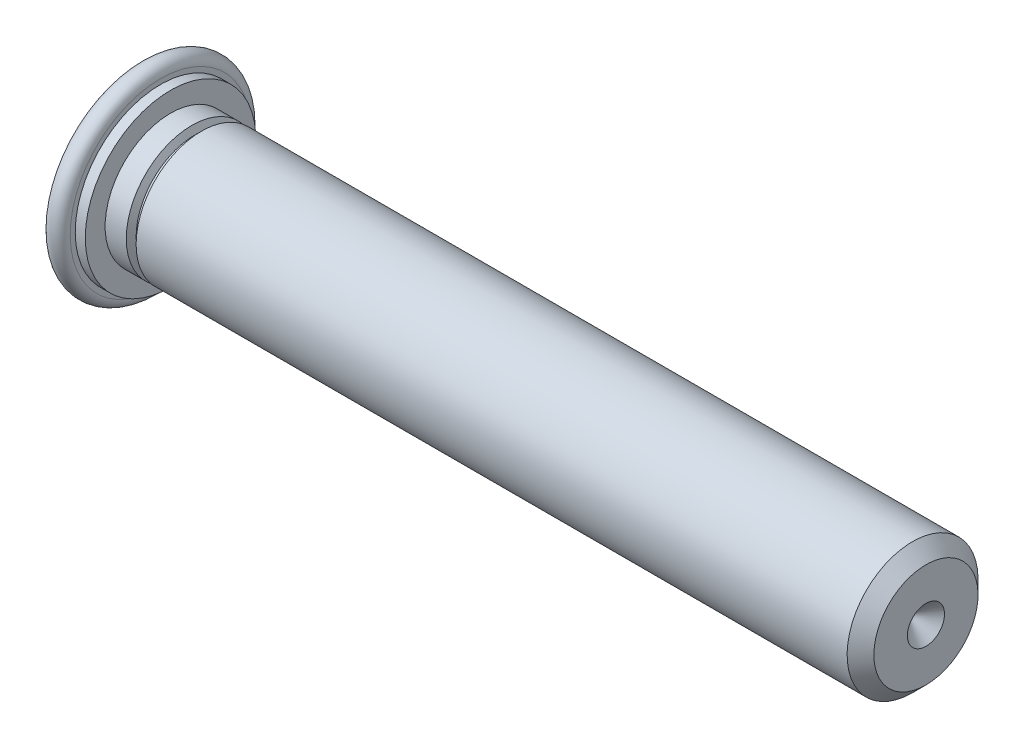
ISO-10303-21;
HEADER;
FILE_DESCRIPTION(('STEP AP214'),'2;1');
FILE_NAME('part.step','',(''),(''),'','','');
FILE_SCHEMA(('AUTOMOTIVE_DESIGN { 1 0 10303 214 1 1 1 1 }'));
ENDSEC;
DATA;
#1=APPLICATION_CONTEXT('core data for automotive mechanical design processes');
#2=APPLICATION_PROTOCOL_DEFINITION('international standard','automotive_design',2000,#1);
#3=PRODUCT_CONTEXT('',#1,'mechanical');
#4=PRODUCT('Part','Part','',(#3));
#5=PRODUCT_RELATED_PRODUCT_CATEGORY('part','',(#4));
#6=PRODUCT_DEFINITION_FORMATION('','',#4);
#7=PRODUCT_DEFINITION_CONTEXT('part definition',#1,'design');
#8=PRODUCT_DEFINITION('design','',#6,#7);
#9=PRODUCT_DEFINITION_SHAPE('','',#8);
#10=(LENGTH_UNIT() NAMED_UNIT(*) SI_UNIT(.MILLI.,.METRE.));
#11=(NAMED_UNIT(*) PLANE_ANGLE_UNIT() SI_UNIT($,.RADIAN.));
#12=(NAMED_UNIT(*) SI_UNIT($,.STERADIAN.) SOLID_ANGLE_UNIT());
#13=UNCERTAINTY_MEASURE_WITH_UNIT(LENGTH_MEASURE(1.E-05),#10,'distance_accuracy_value','');
#14=(GEOMETRIC_REPRESENTATION_CONTEXT(3) GLOBAL_UNCERTAINTY_ASSIGNED_CONTEXT((#13)) GLOBAL_UNIT_ASSIGNED_CONTEXT((#10,
#11,#12)) REPRESENTATION_CONTEXT('',''));
#15=CARTESIAN_POINT('',(0.,0.,0.));
#16=DIRECTION('',(0.,0.,1.));
#17=DIRECTION('',(1.,0.,0.));
#18=AXIS2_PLACEMENT_3D('',#15,#16,#17);
#19=CARTESIAN_POINT('',(18.00000972,0.,0.));
#20=DIRECTION('',(1.,0.,0.));
#21=DIRECTION('',(0.,0.,-1.));
#22=AXIS2_PLACEMENT_3D('',#19,#20,#21);
#23=CONICAL_SURFACE('',#22,0.42550022977,0.785398163397447);
#24=CARTESIAN_POINT('',(17.57450949023,0.,0.));
#25=VERTEX_POINT('',#24);
#26=VERTEX_LOOP('',#25);
#27=FACE_BOUND('',#26,.T.);
#28=CARTESIAN_POINT('',(18.00000972,0.,0.));
#29=DIRECTION('',(1.,0.,0.));
#30=DIRECTION('',(0.,0.,-1.));
#31=AXIS2_PLACEMENT_3D('',#28,#29,#30);
#32=CIRCLE('',#31,0.42550022977);
#33=CARTESIAN_POINT('',(18.00000972,0.,-0.42550022977));
#34=VERTEX_POINT('',#33);
#35=EDGE_CURVE('E21',#34,#34,#32,.F.);
#36=ORIENTED_EDGE('',*,*,#35,.F.);
#37=EDGE_LOOP('',(#36));
#38=FACE_BOUND('',#37,.T.);
#39=ADVANCED_FACE('F17',(#27,#38),#23,.F.);
#40=CARTESIAN_POINT('',(18.00000972,-1.2173706573798,1.19350064449));
#41=DIRECTION('',(1.,0.,0.));
#42=DIRECTION('',(0.,0.,-1.));
#43=AXIS2_PLACEMENT_3D('',#40,#41,#42);
#44=PLANE('',#43);
#45=CARTESIAN_POINT('',(18.00000972,0.,0.));
#46=DIRECTION('',(-1.,0.,0.));
#47=DIRECTION('',(0.,-1.,0.));
#48=AXIS2_PLACEMENT_3D('',#45,#46,#47);
#49=CIRCLE('',#48,1.19350064449);
#50=CARTESIAN_POINT('',(18.00000972,-1.19350064449,0.));
#51=VERTEX_POINT('',#50);
#52=EDGE_CURVE('E36',#51,#51,#49,.T.);
#53=ORIENTED_EDGE('',*,*,#52,.F.);
#54=EDGE_LOOP('',(#53));
#55=FACE_BOUND('',#54,.T.);
#56=ORIENTED_EDGE('',*,*,#35,.T.);
#57=EDGE_LOOP('',(#56));
#58=FACE_BOUND('',#57,.T.);
#59=ADVANCED_FACE('F31',(#55,#58),#44,.T.);
#60=CARTESIAN_POINT('',(17.69350955449,0.,0.));
#61=DIRECTION('',(-1.,0.,0.));
#62=DIRECTION('',(0.,-1.,0.));
#63=AXIS2_PLACEMENT_3D('',#60,#61,#62);
#64=CONICAL_SURFACE('',#63,1.50000081,0.785398163397444);
#65=CARTESIAN_POINT('',(17.69350955449,0.,0.));
#66=DIRECTION('',(-1.,0.,0.));
#67=DIRECTION('',(0.,-1.,0.));
#68=AXIS2_PLACEMENT_3D('',#65,#66,#67);
#69=CIRCLE('',#68,1.50000081);
#70=CARTESIAN_POINT('',(17.69350955449,-1.50000081,0.));
#71=VERTEX_POINT('',#70);
#72=EDGE_CURVE('E38',#71,#71,#69,.T.);
#73=ORIENTED_EDGE('',*,*,#72,.F.);
#74=EDGE_LOOP('',(#73));
#75=FACE_BOUND('',#74,.T.);
#76=ORIENTED_EDGE('',*,*,#52,.T.);
#77=EDGE_LOOP('',(#76));
#78=FACE_BOUND('',#77,.T.);
#79=ADVANCED_FACE('F150',(#75,#78),#64,.T.);
#80=CARTESIAN_POINT('',(1.400000756,0.,0.));
#81=DIRECTION('',(1.,0.,0.));
#82=DIRECTION('',(0.,0.,-1.));
#83=AXIS2_PLACEMENT_3D('',#80,#81,#82);
#84=CYLINDRICAL_SURFACE('',#83,1.50000081);
#85=CARTESIAN_POINT('',(1.400000756,0.,0.));
#86=DIRECTION('',(-1.,0.,0.));
#87=DIRECTION('',(0.,0.,1.));
#88=AXIS2_PLACEMENT_3D('',#85,#86,#87);
#89=CIRCLE('',#88,1.50000081);
#90=CARTESIAN_POINT('',(1.400000756,0.,1.50000081));
#91=VERTEX_POINT('',#90);
#92=EDGE_CURVE('E42',#91,#91,#89,.T.);
#93=ORIENTED_EDGE('',*,*,#92,.F.);
#94=EDGE_LOOP('',(#93));
#95=FACE_BOUND('',#94,.T.);
#96=ORIENTED_EDGE('',*,*,#72,.T.);
#97=EDGE_LOOP('',(#96));
#98=FACE_BOUND('',#97,.T.);
#99=ADVANCED_FACE('F142',(#95,#98),#84,.T.);
#100=CARTESIAN_POINT('',(1.3250007155,0.,0.));
#101=DIRECTION('',(1.,0.,0.));
#102=DIRECTION('',(0.,0.,-1.));
#103=AXIS2_PLACEMENT_3D('',#100,#101,#102);
#104=CONICAL_SURFACE('',#103,1.350000729,1.10714871779409);
#105=ORIENTED_EDGE('',*,*,#92,.T.);
#106=EDGE_LOOP('',(#105));
#107=FACE_BOUND('',#106,.T.);
#108=CARTESIAN_POINT('',(1.32500071545227,0.,0.));
#109=DIRECTION('',(-1.,0.,0.));
#110=DIRECTION('',(0.,0.,1.));
#111=AXIS2_PLACEMENT_3D('',#108,#109,#110);
#112=CIRCLE('',#111,1.35000072908788);
#113=CARTESIAN_POINT('',(1.32500071545227,0.,1.35000072908788));
#114=VERTEX_POINT('',#113);
#115=EDGE_CURVE('E49',#114,#114,#112,.T.);
#116=ORIENTED_EDGE('',*,*,#115,.F.);
#117=EDGE_LOOP('',(#116));
#118=FACE_BOUND('',#117,.T.);
#119=ADVANCED_FACE('F134',(#107,#118),#104,.T.);
#120=CARTESIAN_POINT('',(0.,-2.111401140156,-2.0700011178));
#121=DIRECTION('',(-1.,0.,0.));
#122=DIRECTION('',(0.,0.,1.));
#123=AXIS2_PLACEMENT_3D('',#120,#121,#122);
#124=PLANE('',#123);
#125=CARTESIAN_POINT('',(0.,0.,0.));
#126=DIRECTION('',(1.,0.,0.));
#127=DIRECTION('',(0.,0.,-1.));
#128=AXIS2_PLACEMENT_3D('',#125,#126,#127);
#129=CIRCLE('',#128,2.0700079001343);
#130=CARTESIAN_POINT('',(0.,0.,-2.0700079001343));
#131=VERTEX_POINT('',#130);
#132=EDGE_CURVE('E45',#131,#131,#129,.T.);
#133=ORIENTED_EDGE('',*,*,#132,.F.);
#134=EDGE_LOOP('',(#133));
#135=FACE_BOUND('',#134,.T.);
#136=ADVANCED_FACE('F83',(#135),#124,.T.);
#137=CARTESIAN_POINT('',(1.28750069525,0.,0.));
#138=DIRECTION('',(1.,0.,0.));
#139=DIRECTION('',(0.,0.,-1.));
#140=AXIS2_PLACEMENT_3D('',#137,#138,#139);
#141=TOROIDAL_SURFACE('',#140,1.4149526694733,0.0750000405000002);
#142=ORIENTED_EDGE('',*,*,#115,.T.);
#143=EDGE_LOOP('',(#142));
#144=FACE_BOUND('',#143,.T.);
#145=CARTESIAN_POINT('',(1.25000067501268,0.,0.));
#146=DIRECTION('',(-1.,0.,0.));
#147=DIRECTION('',(0.,0.,1.));
#148=AXIS2_PLACEMENT_3D('',#145,#146,#147);
#149=CIRCLE('',#148,1.35000072906794);
#150=CARTESIAN_POINT('',(1.25000067501268,0.,1.35000072906794));
#151=VERTEX_POINT('',#150);
#152=EDGE_CURVE('E48',#151,#151,#149,.T.);
#153=ORIENTED_EDGE('',*,*,#152,.F.);
#154=EDGE_LOOP('',(#153));
#155=FACE_BOUND('',#154,.T.);
#156=ADVANCED_FACE('F73',(#144,#155),#141,.F.);
#157=CARTESIAN_POINT('',(1.1750006345373,0.,0.));
#158=DIRECTION('',(-1.,0.,0.));
#159=DIRECTION('',(0.,0.,1.));
#160=AXIS2_PLACEMENT_3D('',#157,#158,#159);
#161=CONICAL_SURFACE('',#160,1.5000008100187,1.10714871779409);
#162=ORIENTED_EDGE('',*,*,#152,.T.);
#163=EDGE_LOOP('',(#162));
#164=FACE_BOUND('',#163,.T.);
#165=CARTESIAN_POINT('',(1.1750006345467,0.,0.));
#166=DIRECTION('',(-1.,0.,0.));
#167=DIRECTION('',(0.,0.,1.));
#168=AXIS2_PLACEMENT_3D('',#165,#166,#167);
#169=CIRCLE('',#168,1.50000081);
#170=CARTESIAN_POINT('',(1.1750006345467,0.,1.50000081));
#171=VERTEX_POINT('',#170);
#172=EDGE_CURVE('E54',#171,#171,#169,.T.);
#173=ORIENTED_EDGE('',*,*,#172,.F.);
#174=EDGE_LOOP('',(#173));
#175=FACE_BOUND('',#174,.T.);
#176=ADVANCED_FACE('F70',(#164,#175),#161,.T.);
#177=CARTESIAN_POINT('',(0.2300001242,0.,0.));
#178=DIRECTION('',(1.,0.,0.));
#179=DIRECTION('',(0.,0.,-1.));
#180=AXIS2_PLACEMENT_3D('',#177,#178,#179);
#181=TOROIDAL_SURFACE('',#180,2.0700079001343,0.2300001242);
#182=ORIENTED_EDGE('',*,*,#132,.T.);
#183=EDGE_LOOP('',(#182));
#184=FACE_BOUND('',#183,.T.);
#185=CARTESIAN_POINT('',(0.4600002483,0.,0.));
#186=DIRECTION('',(1.,0.,0.));
#187=DIRECTION('',(0.,0.,-1.));
#188=AXIS2_PLACEMENT_3D('',#185,#186,#187);
#189=CIRCLE('',#188,2.0700011178);
#190=CARTESIAN_POINT('',(0.4600002483,0.,-2.0700011178));
#191=VERTEX_POINT('',#190);
#192=EDGE_CURVE('E50',#191,#191,#189,.T.);
#193=ORIENTED_EDGE('',*,*,#192,.F.);
#194=EDGE_LOOP('',(#193));
#195=FACE_BOUND('',#194,.T.);
#196=ADVANCED_FACE('F72',(#184,#195),#181,.T.);
#197=CARTESIAN_POINT('',(0.6900003726,0.,0.));
#198=DIRECTION('',(1.,0.,0.));
#199=DIRECTION('',(0.,0.,-1.));
#200=AXIS2_PLACEMENT_3D('',#197,#198,#199);
#201=CYLINDRICAL_SURFACE('',#200,1.50000081);
#202=CARTESIAN_POINT('',(0.6900003726,0.,0.));
#203=DIRECTION('',(1.,0.,0.));
#204=DIRECTION('',(0.,0.,-1.));
#205=AXIS2_PLACEMENT_3D('',#202,#203,#204);
#206=CIRCLE('',#205,1.50000081);
#207=CARTESIAN_POINT('',(0.6900003726,0.,-1.50000081));
#208=VERTEX_POINT('',#207);
#209=EDGE_CURVE('E53',#208,#208,#206,.F.);
#210=ORIENTED_EDGE('',*,*,#209,.F.);
#211=EDGE_LOOP('',(#210));
#212=FACE_BOUND('',#211,.T.);
#213=ORIENTED_EDGE('',*,*,#172,.T.);
#214=EDGE_LOOP('',(#213));
#215=FACE_BOUND('',#214,.T.);
#216=ADVANCED_FACE('F68',(#212,#215),#201,.T.);
#217=CARTESIAN_POINT('',(0.46000024835,-2.111401140156,2.0700011178));
#218=DIRECTION('',(1.,0.,0.));
#219=DIRECTION('',(0.,0.,-1.));
#220=AXIS2_PLACEMENT_3D('',#217,#218,#219);
#221=PLANE('',#220);
#222=CARTESIAN_POINT('',(0.46000024835,0.,0.));
#223=DIRECTION('',(-1.,0.,0.));
#224=DIRECTION('',(0.,0.,1.));
#225=AXIS2_PLACEMENT_3D('',#222,#223,#224);
#226=CIRCLE('',#225,1.9550010557);
#227=CARTESIAN_POINT('',(0.46000024835,0.,1.9550010557));
#228=VERTEX_POINT('',#227);
#229=EDGE_CURVE('E25',#228,#228,#226,.F.);
#230=ORIENTED_EDGE('',*,*,#229,.F.);
#231=EDGE_LOOP('',(#230));
#232=FACE_BOUND('',#231,.T.);
#233=ORIENTED_EDGE('',*,*,#192,.T.);
#234=EDGE_LOOP('',(#233));
#235=FACE_BOUND('',#234,.T.);
#236=ADVANCED_FACE('F92',(#232,#235),#221,.T.);
#237=CARTESIAN_POINT('',(0.6900003726,1.994101076814,-1.9550010557));
#238=DIRECTION('',(1.,0.,0.));
#239=DIRECTION('',(0.,0.,1.));
#240=AXIS2_PLACEMENT_3D('',#237,#238,#239);
#241=PLANE('',#240);
#242=CARTESIAN_POINT('',(0.6900003726,0.,0.));
#243=DIRECTION('',(-1.,0.,0.));
#244=DIRECTION('',(0.,0.,1.));
#245=AXIS2_PLACEMENT_3D('',#242,#243,#244);
#246=CIRCLE('',#245,1.9550010557);
#247=CARTESIAN_POINT('',(0.6900003726,0.,1.9550010557));
#248=VERTEX_POINT('',#247);
#249=EDGE_CURVE('E11',#248,#248,#246,.T.);
#250=ORIENTED_EDGE('',*,*,#249,.F.);
#251=EDGE_LOOP('',(#250));
#252=FACE_BOUND('',#251,.T.);
#253=ORIENTED_EDGE('',*,*,#209,.T.);
#254=EDGE_LOOP('',(#253));
#255=FACE_BOUND('',#254,.T.);
#256=ADVANCED_FACE('F87',(#252,#255),#241,.T.);
#257=CARTESIAN_POINT('',(0.6900003726,0.,0.));
#258=DIRECTION('',(-1.,0.,0.));
#259=DIRECTION('',(0.,0.,1.));
#260=AXIS2_PLACEMENT_3D('',#257,#258,#259);
#261=CYLINDRICAL_SURFACE('',#260,1.9550010557);
#262=ORIENTED_EDGE('',*,*,#249,.T.);
#263=EDGE_LOOP('',(#262));
#264=FACE_BOUND('',#263,.T.);
#265=ORIENTED_EDGE('',*,*,#229,.T.);
#266=EDGE_LOOP('',(#265));
#267=FACE_BOUND('',#266,.T.);
#268=ADVANCED_FACE('F19',(#264,#267),#261,.T.);
#269=CLOSED_SHELL('',(#39,#59,#79,#99,#119,#136,#156,#176,#196,#216,#236,#256,#268));
#270=MANIFOLD_SOLID_BREP('B1',#269);
#271=ADVANCED_BREP_SHAPE_REPRESENTATION('',(#18,#270),#14);
#272=SHAPE_DEFINITION_REPRESENTATION(#9,#271);
ENDSEC;
END-ISO-10303-21;
